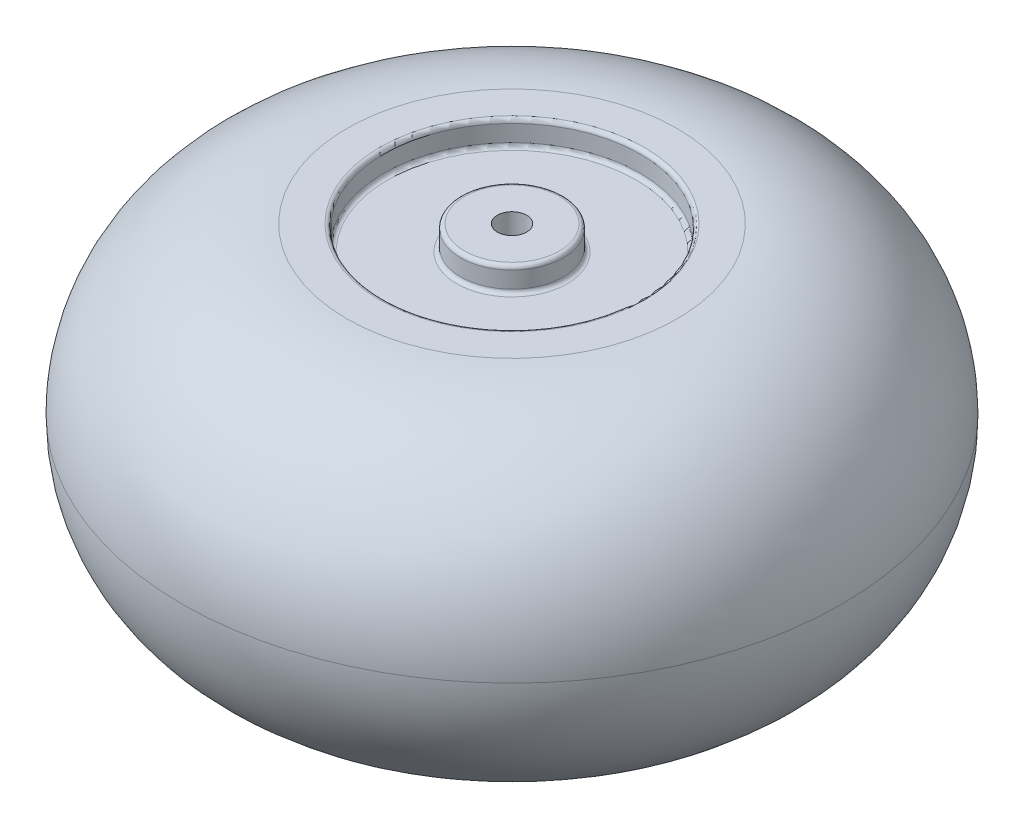
ISO-10303-21;
HEADER;
FILE_DESCRIPTION(('STEP AP214'),'2;1');
FILE_NAME('part.step','',(''),(''),'','','');
FILE_SCHEMA(('AUTOMOTIVE_DESIGN { 1 0 10303 214 1 1 1 1 }'));
ENDSEC;
DATA;
#1=APPLICATION_CONTEXT('core data for automotive mechanical design processes');
#2=APPLICATION_PROTOCOL_DEFINITION('international standard','automotive_design',2000,#1);
#3=PRODUCT_CONTEXT('',#1,'mechanical');
#4=PRODUCT('Part','Part','',(#3));
#5=PRODUCT_RELATED_PRODUCT_CATEGORY('part','',(#4));
#6=PRODUCT_DEFINITION_FORMATION('','',#4);
#7=PRODUCT_DEFINITION_CONTEXT('part definition',#1,'design');
#8=PRODUCT_DEFINITION('design','',#6,#7);
#9=PRODUCT_DEFINITION_SHAPE('','',#8);
#10=(LENGTH_UNIT() NAMED_UNIT(*) SI_UNIT(.MILLI.,.METRE.));
#11=(NAMED_UNIT(*) PLANE_ANGLE_UNIT() SI_UNIT($,.RADIAN.));
#12=(NAMED_UNIT(*) SI_UNIT($,.STERADIAN.) SOLID_ANGLE_UNIT());
#13=UNCERTAINTY_MEASURE_WITH_UNIT(LENGTH_MEASURE(1.E-05),#10,'distance_accuracy_value','');
#14=(GEOMETRIC_REPRESENTATION_CONTEXT(3) GLOBAL_UNCERTAINTY_ASSIGNED_CONTEXT((#13)) GLOBAL_UNIT_ASSIGNED_CONTEXT((#10,
#11,#12)) REPRESENTATION_CONTEXT('',''));
#15=CARTESIAN_POINT('',(0.,0.,0.));
#16=DIRECTION('',(0.,0.,1.));
#17=DIRECTION('',(1.,0.,0.));
#18=AXIS2_PLACEMENT_3D('',#15,#16,#17);
#19=CARTESIAN_POINT('',(0.,67.4999999999999,-6.));
#20=DIRECTION('',(0.,1.,0.));
#21=DIRECTION('',(0.,0.,1.));
#22=AXIS2_PLACEMENT_3D('',#19,#20,#21);
#23=PLANE('',#22);
#24=CARTESIAN_POINT('',(0.,67.4999999999999,0.));
#25=DIRECTION('',(0.,-1.,0.));
#26=DIRECTION('',(0.,0.,-1.));
#27=AXIS2_PLACEMENT_3D('',#24,#25,#26);
#28=CIRCLE('',#27,6.);
#29=CARTESIAN_POINT('',(0.,67.4999999999999,-6.));
#30=VERTEX_POINT('',#29);
#31=EDGE_CURVE('E128',#30,#30,#28,.T.);
#32=ORIENTED_EDGE('',*,*,#31,.T.);
#33=EDGE_LOOP('',(#32));
#34=FACE_BOUND('',#33,.T.);
#35=CARTESIAN_POINT('',(0.,67.4999999999999,0.));
#36=DIRECTION('',(0.,-1.,0.));
#37=DIRECTION('',(0.,0.,-1.));
#38=AXIS2_PLACEMENT_3D('',#35,#36,#37);
#39=CIRCLE('',#38,19.3864252617363);
#40=CARTESIAN_POINT('',(0.,67.4999999999999,-19.3864252617363));
#41=VERTEX_POINT('',#40);
#42=EDGE_CURVE('E10',#41,#41,#39,.T.);
#43=ORIENTED_EDGE('',*,*,#42,.F.);
#44=EDGE_LOOP('',(#43));
#45=FACE_BOUND('',#44,.T.);
#46=ADVANCED_FACE('F39',(#34,#45),#23,.T.);
#47=CARTESIAN_POINT('',(0.,65.8864252617362,0.));
#48=DIRECTION('',(0.,-1.,0.));
#49=DIRECTION('',(0.,0.,-1.));
#50=AXIS2_PLACEMENT_3D('',#47,#48,#49);
#51=TOROIDAL_SURFACE('',#50,19.3864252617363,1.61357473826368);
#52=ORIENTED_EDGE('',*,*,#42,.T.);
#53=EDGE_LOOP('',(#52));
#54=FACE_BOUND('',#53,.T.);
#55=CARTESIAN_POINT('',(0.,65.8864252617362,0.));
#56=DIRECTION('',(0.,-1.,0.));
#57=DIRECTION('',(0.,0.,-1.));
#58=AXIS2_PLACEMENT_3D('',#55,#56,#57);
#59=CIRCLE('',#58,21.);
#60=CARTESIAN_POINT('',(0.,65.8864252617362,-21.));
#61=VERTEX_POINT('',#60);
#62=EDGE_CURVE('E46',#61,#61,#59,.T.);
#63=ORIENTED_EDGE('',*,*,#62,.F.);
#64=EDGE_LOOP('',(#63));
#65=FACE_BOUND('',#64,.T.);
#66=ADVANCED_FACE('F148',(#54,#65),#51,.T.);
#67=CARTESIAN_POINT('',(0.,0.,0.));
#68=DIRECTION('',(0.,-1.,0.));
#69=DIRECTION('',(0.,0.,-1.));
#70=AXIS2_PLACEMENT_3D('',#67,#68,#69);
#71=CYLINDRICAL_SURFACE('',#70,21.);
#72=ORIENTED_EDGE('',*,*,#62,.T.);
#73=EDGE_LOOP('',(#72));
#74=FACE_BOUND('',#73,.T.);
#75=CARTESIAN_POINT('',(0.,59.1135747382636,0.));
#76=DIRECTION('',(0.,-1.,0.));
#77=DIRECTION('',(0.,0.,-1.));
#78=AXIS2_PLACEMENT_3D('',#75,#76,#77);
#79=CIRCLE('',#78,21.);
#80=CARTESIAN_POINT('',(0.,59.1135747382636,-21.));
#81=VERTEX_POINT('',#80);
#82=EDGE_CURVE('E52',#81,#81,#79,.T.);
#83=ORIENTED_EDGE('',*,*,#82,.F.);
#84=EDGE_LOOP('',(#83));
#85=FACE_BOUND('',#84,.T.);
#86=ADVANCED_FACE('F152',(#74,#85),#71,.T.);
#87=CARTESIAN_POINT('',(0.,59.1135747382636,0.));
#88=DIRECTION('',(0.,-1.,0.));
#89=DIRECTION('',(0.,0.,-1.));
#90=AXIS2_PLACEMENT_3D('',#87,#88,#89);
#91=TOROIDAL_SURFACE('',#90,22.6135747382637,1.61357473826369);
#92=ORIENTED_EDGE('',*,*,#82,.T.);
#93=EDGE_LOOP('',(#92));
#94=FACE_BOUND('',#93,.T.);
#95=CARTESIAN_POINT('',(0.,57.5,0.));
#96=DIRECTION('',(0.,-1.,0.));
#97=DIRECTION('',(0.,0.,-1.));
#98=AXIS2_PLACEMENT_3D('',#95,#96,#97);
#99=CIRCLE('',#98,22.6135747382637);
#100=CARTESIAN_POINT('',(0.,57.5,-22.6135747382637));
#101=VERTEX_POINT('',#100);
#102=EDGE_CURVE('E58',#101,#101,#99,.T.);
#103=ORIENTED_EDGE('',*,*,#102,.F.);
#104=EDGE_LOOP('',(#103));
#105=FACE_BOUND('',#104,.T.);
#106=ADVANCED_FACE('F156',(#94,#105),#91,.F.);
#107=CARTESIAN_POINT('',(0.,57.4999999999999,-22.6135747382637));
#108=DIRECTION('',(0.,1.,0.));
#109=DIRECTION('',(0.,0.,1.));
#110=AXIS2_PLACEMENT_3D('',#107,#108,#109);
#111=PLANE('',#110);
#112=ORIENTED_EDGE('',*,*,#102,.T.);
#113=EDGE_LOOP('',(#112));
#114=FACE_BOUND('',#113,.T.);
#115=CARTESIAN_POINT('',(0.,57.4999999999999,0.));
#116=DIRECTION('',(0.,-1.,0.));
#117=DIRECTION('',(0.,0.,-1.));
#118=AXIS2_PLACEMENT_3D('',#115,#116,#117);
#119=CIRCLE('',#118,50.9196229294904);
#120=CARTESIAN_POINT('',(0.,57.4999999999999,-50.9196229294904));
#121=VERTEX_POINT('',#120);
#122=EDGE_CURVE('E64',#121,#121,#119,.T.);
#123=ORIENTED_EDGE('',*,*,#122,.F.);
#124=EDGE_LOOP('',(#123));
#125=FACE_BOUND('',#124,.T.);
#126=ADVANCED_FACE('F162',(#114,#125),#111,.T.);
#127=CARTESIAN_POINT('',(0.,59.1135747382636,0.));
#128=DIRECTION('',(0.,-1.,0.));
#129=DIRECTION('',(0.,0.,-1.));
#130=AXIS2_PLACEMENT_3D('',#127,#128,#129);
#131=TOROIDAL_SURFACE('',#130,50.9196229294904,1.61357473826369);
#132=ORIENTED_EDGE('',*,*,#122,.T.);
#133=EDGE_LOOP('',(#132));
#134=FACE_BOUND('',#133,.T.);
#135=CARTESIAN_POINT('',(0.,59.1135747382636,0.));
#136=DIRECTION('',(0.,-1.,0.));
#137=DIRECTION('',(0.,0.,-1.));
#138=AXIS2_PLACEMENT_3D('',#135,#136,#137);
#139=CIRCLE('',#138,52.5331976677541);
#140=CARTESIAN_POINT('',(0.,59.1135747382636,-52.5331976677541));
#141=VERTEX_POINT('',#140);
#142=EDGE_CURVE('E68',#141,#141,#139,.T.);
#143=ORIENTED_EDGE('',*,*,#142,.F.);
#144=EDGE_LOOP('',(#143));
#145=FACE_BOUND('',#144,.T.);
#146=ADVANCED_FACE('F166',(#134,#145),#131,.F.);
#147=CARTESIAN_POINT('',(0.,0.,0.));
#148=DIRECTION('',(0.,-1.,0.));
#149=DIRECTION('',(0.,0.,-1.));
#150=AXIS2_PLACEMENT_3D('',#147,#148,#149);
#151=CYLINDRICAL_SURFACE('',#150,52.5331976677541);
#152=ORIENTED_EDGE('',*,*,#142,.T.);
#153=EDGE_LOOP('',(#152));
#154=FACE_BOUND('',#153,.T.);
#155=CARTESIAN_POINT('',(0.,65.8864252617362,0.));
#156=DIRECTION('',(0.,-1.,0.));
#157=DIRECTION('',(0.,0.,-1.));
#158=AXIS2_PLACEMENT_3D('',#155,#156,#157);
#159=CIRCLE('',#158,52.5331976677541);
#160=CARTESIAN_POINT('',(0.,65.8864252617362,-52.5331976677541));
#161=VERTEX_POINT('',#160);
#162=EDGE_CURVE('E72',#161,#161,#159,.T.);
#163=ORIENTED_EDGE('',*,*,#162,.F.);
#164=EDGE_LOOP('',(#163));
#165=FACE_BOUND('',#164,.T.);
#166=ADVANCED_FACE('F170',(#154,#165),#151,.F.);
#167=CARTESIAN_POINT('',(0.,65.8864252617362,0.));
#168=DIRECTION('',(0.,-1.,0.));
#169=DIRECTION('',(0.,0.,-1.));
#170=AXIS2_PLACEMENT_3D('',#167,#168,#169);
#171=TOROIDAL_SURFACE('',#170,54.1467724060178,1.61357473826368);
#172=ORIENTED_EDGE('',*,*,#162,.T.);
#173=EDGE_LOOP('',(#172));
#174=FACE_BOUND('',#173,.T.);
#175=CARTESIAN_POINT('',(0.,67.4999999999999,0.));
#176=DIRECTION('',(0.,-1.,0.));
#177=DIRECTION('',(0.,0.,-1.));
#178=AXIS2_PLACEMENT_3D('',#175,#176,#177);
#179=CIRCLE('',#178,54.1467724060178);
#180=CARTESIAN_POINT('',(0.,67.4999999999999,-54.1467724060178));
#181=VERTEX_POINT('',#180);
#182=EDGE_CURVE('E76',#181,#181,#179,.T.);
#183=ORIENTED_EDGE('',*,*,#182,.F.);
#184=EDGE_LOOP('',(#183));
#185=FACE_BOUND('',#184,.T.);
#186=ADVANCED_FACE('F174',(#174,#185),#171,.T.);
#187=CARTESIAN_POINT('',(0.,67.4999999999999,-54.1467724060178));
#188=DIRECTION('',(0.,1.,0.));
#189=DIRECTION('',(0.,0.,1.));
#190=AXIS2_PLACEMENT_3D('',#187,#188,#189);
#191=PLANE('',#190);
#192=ORIENTED_EDGE('',*,*,#182,.T.);
#193=EDGE_LOOP('',(#192));
#194=FACE_BOUND('',#193,.T.);
#195=CARTESIAN_POINT('',(0.,67.4999999999999,0.));
#196=DIRECTION('',(0.,-1.,0.));
#197=DIRECTION('',(0.,0.,-1.));
#198=AXIS2_PLACEMENT_3D('',#195,#196,#197);
#199=CIRCLE('',#198,67.5331976677541);
#200=CARTESIAN_POINT('',(0.,67.4999999999999,-67.5331976677541));
#201=VERTEX_POINT('',#200);
#202=EDGE_CURVE('E80',#201,#201,#199,.T.);
#203=ORIENTED_EDGE('',*,*,#202,.F.);
#204=EDGE_LOOP('',(#203));
#205=FACE_BOUND('',#204,.T.);
#206=ADVANCED_FACE('F178',(#194,#205),#191,.T.);
#207=CARTESIAN_POINT('',(0.,0.175643854055427,0.));
#208=DIRECTION('',(0.,-1.,0.));
#209=DIRECTION('',(0.,0.,-1.));
#210=AXIS2_PLACEMENT_3D('',#207,#208,#209);
#211=TOROIDAL_SURFACE('',#210,67.5331976677541,67.3243561459445);
#212=ORIENTED_EDGE('',*,*,#202,.T.);
#213=EDGE_LOOP('',(#212));
#214=FACE_BOUND('',#213,.T.);
#215=CARTESIAN_POINT('',(0.,0.,0.));
#216=DIRECTION('',(0.,-1.,0.));
#217=DIRECTION('',(0.,0.,-1.));
#218=AXIS2_PLACEMENT_3D('',#215,#216,#217);
#219=CIRCLE('',#218,134.857324692934);
#220=CARTESIAN_POINT('',(0.,0.,-134.857324692934));
#221=VERTEX_POINT('',#220);
#222=EDGE_CURVE('E84',#221,#221,#219,.T.);
#223=ORIENTED_EDGE('',*,*,#222,.F.);
#224=EDGE_LOOP('',(#223));
#225=FACE_BOUND('',#224,.T.);
#226=ADVANCED_FACE('F182',(#214,#225),#211,.T.);
#227=CARTESIAN_POINT('',(0.,-0.175643854055427,0.));
#228=DIRECTION('',(0.,-1.,0.));
#229=DIRECTION('',(0.,0.,-1.));
#230=AXIS2_PLACEMENT_3D('',#227,#228,#229);
#231=TOROIDAL_SURFACE('',#230,67.5331976677541,67.3243561459445);
#232=ORIENTED_EDGE('',*,*,#222,.T.);
#233=EDGE_LOOP('',(#232));
#234=FACE_BOUND('',#233,.T.);
#235=CARTESIAN_POINT('',(0.,-67.4999999999999,0.));
#236=DIRECTION('',(0.,-1.,0.));
#237=DIRECTION('',(0.,0.,-1.));
#238=AXIS2_PLACEMENT_3D('',#235,#236,#237);
#239=CIRCLE('',#238,67.5331976677541);
#240=CARTESIAN_POINT('',(0.,-67.4999999999999,-67.5331976677541));
#241=VERTEX_POINT('',#240);
#242=EDGE_CURVE('E88',#241,#241,#239,.T.);
#243=ORIENTED_EDGE('',*,*,#242,.F.);
#244=EDGE_LOOP('',(#243));
#245=FACE_BOUND('',#244,.T.);
#246=ADVANCED_FACE('F186',(#234,#245),#231,.T.);
#247=CARTESIAN_POINT('',(0.,-67.4999999999999,-54.1467724060178));
#248=DIRECTION('',(0.,-1.,0.));
#249=DIRECTION('',(0.,0.,-1.));
#250=AXIS2_PLACEMENT_3D('',#247,#248,#249);
#251=PLANE('',#250);
#252=ORIENTED_EDGE('',*,*,#242,.T.);
#253=EDGE_LOOP('',(#252));
#254=FACE_BOUND('',#253,.T.);
#255=CARTESIAN_POINT('',(0.,-67.4999999999999,0.));
#256=DIRECTION('',(0.,-1.,0.));
#257=DIRECTION('',(0.,0.,-1.));
#258=AXIS2_PLACEMENT_3D('',#255,#256,#257);
#259=CIRCLE('',#258,54.1467724060178);
#260=CARTESIAN_POINT('',(0.,-67.4999999999999,-54.1467724060178));
#261=VERTEX_POINT('',#260);
#262=EDGE_CURVE('E92',#261,#261,#259,.T.);
#263=ORIENTED_EDGE('',*,*,#262,.F.);
#264=EDGE_LOOP('',(#263));
#265=FACE_BOUND('',#264,.T.);
#266=ADVANCED_FACE('F190',(#254,#265),#251,.T.);
#267=CARTESIAN_POINT('',(0.,-65.8864252617362,0.));
#268=DIRECTION('',(0.,-1.,0.));
#269=DIRECTION('',(0.,0.,-1.));
#270=AXIS2_PLACEMENT_3D('',#267,#268,#269);
#271=TOROIDAL_SURFACE('',#270,54.1467724060178,1.61357473826368);
#272=ORIENTED_EDGE('',*,*,#262,.T.);
#273=EDGE_LOOP('',(#272));
#274=FACE_BOUND('',#273,.T.);
#275=CARTESIAN_POINT('',(0.,-65.8864252617362,0.));
#276=DIRECTION('',(0.,-1.,0.));
#277=DIRECTION('',(0.,0.,-1.));
#278=AXIS2_PLACEMENT_3D('',#275,#276,#277);
#279=CIRCLE('',#278,52.5331976677541);
#280=CARTESIAN_POINT('',(0.,-65.8864252617362,-52.5331976677541));
#281=VERTEX_POINT('',#280);
#282=EDGE_CURVE('E96',#281,#281,#279,.T.);
#283=ORIENTED_EDGE('',*,*,#282,.F.);
#284=EDGE_LOOP('',(#283));
#285=FACE_BOUND('',#284,.T.);
#286=ADVANCED_FACE('F194',(#274,#285),#271,.T.);
#287=CARTESIAN_POINT('',(0.,0.,0.));
#288=DIRECTION('',(0.,-1.,0.));
#289=DIRECTION('',(0.,0.,-1.));
#290=AXIS2_PLACEMENT_3D('',#287,#288,#289);
#291=CYLINDRICAL_SURFACE('',#290,52.5331976677541);
#292=ORIENTED_EDGE('',*,*,#282,.T.);
#293=EDGE_LOOP('',(#292));
#294=FACE_BOUND('',#293,.T.);
#295=CARTESIAN_POINT('',(0.,-59.1135747382636,0.));
#296=DIRECTION('',(0.,-1.,0.));
#297=DIRECTION('',(0.,0.,-1.));
#298=AXIS2_PLACEMENT_3D('',#295,#296,#297);
#299=CIRCLE('',#298,52.5331976677541);
#300=CARTESIAN_POINT('',(0.,-59.1135747382636,-52.5331976677541));
#301=VERTEX_POINT('',#300);
#302=EDGE_CURVE('E100',#301,#301,#299,.T.);
#303=ORIENTED_EDGE('',*,*,#302,.F.);
#304=EDGE_LOOP('',(#303));
#305=FACE_BOUND('',#304,.T.);
#306=ADVANCED_FACE('F198',(#294,#305),#291,.F.);
#307=CARTESIAN_POINT('',(0.,-59.1135747382636,0.));
#308=DIRECTION('',(0.,-1.,0.));
#309=DIRECTION('',(0.,0.,-1.));
#310=AXIS2_PLACEMENT_3D('',#307,#308,#309);
#311=TOROIDAL_SURFACE('',#310,50.9196229294904,1.61357473826369);
#312=ORIENTED_EDGE('',*,*,#302,.T.);
#313=EDGE_LOOP('',(#312));
#314=FACE_BOUND('',#313,.T.);
#315=CARTESIAN_POINT('',(0.,-57.4999999999999,0.));
#316=DIRECTION('',(0.,-1.,0.));
#317=DIRECTION('',(0.,0.,-1.));
#318=AXIS2_PLACEMENT_3D('',#315,#316,#317);
#319=CIRCLE('',#318,50.9196229294904);
#320=CARTESIAN_POINT('',(0.,-57.4999999999999,-50.9196229294904));
#321=VERTEX_POINT('',#320);
#322=EDGE_CURVE('E104',#321,#321,#319,.T.);
#323=ORIENTED_EDGE('',*,*,#322,.F.);
#324=EDGE_LOOP('',(#323));
#325=FACE_BOUND('',#324,.T.);
#326=ADVANCED_FACE('F202',(#314,#325),#311,.F.);
#327=CARTESIAN_POINT('',(0.,-57.4999999999999,-22.6135747382637));
#328=DIRECTION('',(0.,-1.,0.));
#329=DIRECTION('',(0.,0.,-1.));
#330=AXIS2_PLACEMENT_3D('',#327,#328,#329);
#331=PLANE('',#330);
#332=ORIENTED_EDGE('',*,*,#322,.T.);
#333=EDGE_LOOP('',(#332));
#334=FACE_BOUND('',#333,.T.);
#335=CARTESIAN_POINT('',(0.,-57.4999999999999,0.));
#336=DIRECTION('',(0.,-1.,0.));
#337=DIRECTION('',(0.,0.,-1.));
#338=AXIS2_PLACEMENT_3D('',#335,#336,#337);
#339=CIRCLE('',#338,22.6135747382637);
#340=CARTESIAN_POINT('',(0.,-57.4999999999999,-22.6135747382637));
#341=VERTEX_POINT('',#340);
#342=EDGE_CURVE('E108',#341,#341,#339,.T.);
#343=ORIENTED_EDGE('',*,*,#342,.F.);
#344=EDGE_LOOP('',(#343));
#345=FACE_BOUND('',#344,.T.);
#346=ADVANCED_FACE('F206',(#334,#345),#331,.T.);
#347=CARTESIAN_POINT('',(0.,-59.1135747382636,0.));
#348=DIRECTION('',(0.,-1.,0.));
#349=DIRECTION('',(0.,0.,-1.));
#350=AXIS2_PLACEMENT_3D('',#347,#348,#349);
#351=TOROIDAL_SURFACE('',#350,22.6135747382637,1.61357473826367);
#352=ORIENTED_EDGE('',*,*,#342,.T.);
#353=EDGE_LOOP('',(#352));
#354=FACE_BOUND('',#353,.T.);
#355=CARTESIAN_POINT('',(0.,-59.1135747382636,0.));
#356=DIRECTION('',(0.,-1.,0.));
#357=DIRECTION('',(0.,0.,-1.));
#358=AXIS2_PLACEMENT_3D('',#355,#356,#357);
#359=CIRCLE('',#358,21.);
#360=CARTESIAN_POINT('',(0.,-59.1135747382636,-21.));
#361=VERTEX_POINT('',#360);
#362=EDGE_CURVE('E112',#361,#361,#359,.T.);
#363=ORIENTED_EDGE('',*,*,#362,.F.);
#364=EDGE_LOOP('',(#363));
#365=FACE_BOUND('',#364,.T.);
#366=ADVANCED_FACE('F210',(#354,#365),#351,.F.);
#367=CARTESIAN_POINT('',(0.,0.,0.));
#368=DIRECTION('',(0.,-1.,0.));
#369=DIRECTION('',(0.,0.,-1.));
#370=AXIS2_PLACEMENT_3D('',#367,#368,#369);
#371=CYLINDRICAL_SURFACE('',#370,21.);
#372=ORIENTED_EDGE('',*,*,#362,.T.);
#373=EDGE_LOOP('',(#372));
#374=FACE_BOUND('',#373,.T.);
#375=CARTESIAN_POINT('',(0.,-65.8864252617362,0.));
#376=DIRECTION('',(0.,-1.,0.));
#377=DIRECTION('',(0.,0.,-1.));
#378=AXIS2_PLACEMENT_3D('',#375,#376,#377);
#379=CIRCLE('',#378,21.);
#380=CARTESIAN_POINT('',(0.,-65.8864252617362,-21.));
#381=VERTEX_POINT('',#380);
#382=EDGE_CURVE('E116',#381,#381,#379,.T.);
#383=ORIENTED_EDGE('',*,*,#382,.F.);
#384=EDGE_LOOP('',(#383));
#385=FACE_BOUND('',#384,.T.);
#386=ADVANCED_FACE('F214',(#374,#385),#371,.T.);
#387=CARTESIAN_POINT('',(0.,-65.8864252617362,0.));
#388=DIRECTION('',(0.,-1.,0.));
#389=DIRECTION('',(0.,0.,-1.));
#390=AXIS2_PLACEMENT_3D('',#387,#388,#389);
#391=TOROIDAL_SURFACE('',#390,19.3864252617363,1.61357473826368);
#392=ORIENTED_EDGE('',*,*,#382,.T.);
#393=EDGE_LOOP('',(#392));
#394=FACE_BOUND('',#393,.T.);
#395=CARTESIAN_POINT('',(0.,-67.4999999999999,0.));
#396=DIRECTION('',(0.,-1.,0.));
#397=DIRECTION('',(0.,0.,-1.));
#398=AXIS2_PLACEMENT_3D('',#395,#396,#397);
#399=CIRCLE('',#398,19.3864252617363);
#400=CARTESIAN_POINT('',(0.,-67.4999999999999,-19.3864252617363));
#401=VERTEX_POINT('',#400);
#402=EDGE_CURVE('E120',#401,#401,#399,.T.);
#403=ORIENTED_EDGE('',*,*,#402,.F.);
#404=EDGE_LOOP('',(#403));
#405=FACE_BOUND('',#404,.T.);
#406=ADVANCED_FACE('F144',(#394,#405),#391,.T.);
#407=CARTESIAN_POINT('',(0.,-67.4999999999999,-6.));
#408=DIRECTION('',(0.,-1.,0.));
#409=DIRECTION('',(0.,0.,-1.));
#410=AXIS2_PLACEMENT_3D('',#407,#408,#409);
#411=PLANE('',#410);
#412=ORIENTED_EDGE('',*,*,#402,.T.);
#413=EDGE_LOOP('',(#412));
#414=FACE_BOUND('',#413,.T.);
#415=CARTESIAN_POINT('',(0.,-67.4999999999999,0.));
#416=DIRECTION('',(0.,-1.,0.));
#417=DIRECTION('',(0.,0.,-1.));
#418=AXIS2_PLACEMENT_3D('',#415,#416,#417);
#419=CIRCLE('',#418,6.);
#420=CARTESIAN_POINT('',(0.,-67.4999999999999,-6.));
#421=VERTEX_POINT('',#420);
#422=EDGE_CURVE('E124',#421,#421,#419,.T.);
#423=ORIENTED_EDGE('',*,*,#422,.F.);
#424=EDGE_LOOP('',(#423));
#425=FACE_BOUND('',#424,.T.);
#426=ADVANCED_FACE('F138',(#414,#425),#411,.T.);
#427=CARTESIAN_POINT('',(0.,0.,0.));
#428=DIRECTION('',(0.,-1.,0.));
#429=DIRECTION('',(0.,0.,-1.));
#430=AXIS2_PLACEMENT_3D('',#427,#428,#429);
#431=CYLINDRICAL_SURFACE('',#430,6.);
#432=ORIENTED_EDGE('',*,*,#422,.T.);
#433=EDGE_LOOP('',(#432));
#434=FACE_BOUND('',#433,.T.);
#435=ORIENTED_EDGE('',*,*,#31,.F.);
#436=EDGE_LOOP('',(#435));
#437=FACE_BOUND('',#436,.T.);
#438=ADVANCED_FACE('F136',(#434,#437),#431,.F.);
#439=CLOSED_SHELL('',(#46,#66,#86,#106,#126,#146,#166,#186,#206,#226,#246,#266,#286,#306,#326,
#346,#366,#386,#406,#426,#438));
#440=MANIFOLD_SOLID_BREP('B2',#439);
#441=ADVANCED_BREP_SHAPE_REPRESENTATION('',(#18,#440),#14);
#442=SHAPE_DEFINITION_REPRESENTATION(#9,#441);
ENDSEC;
END-ISO-10303-21;
